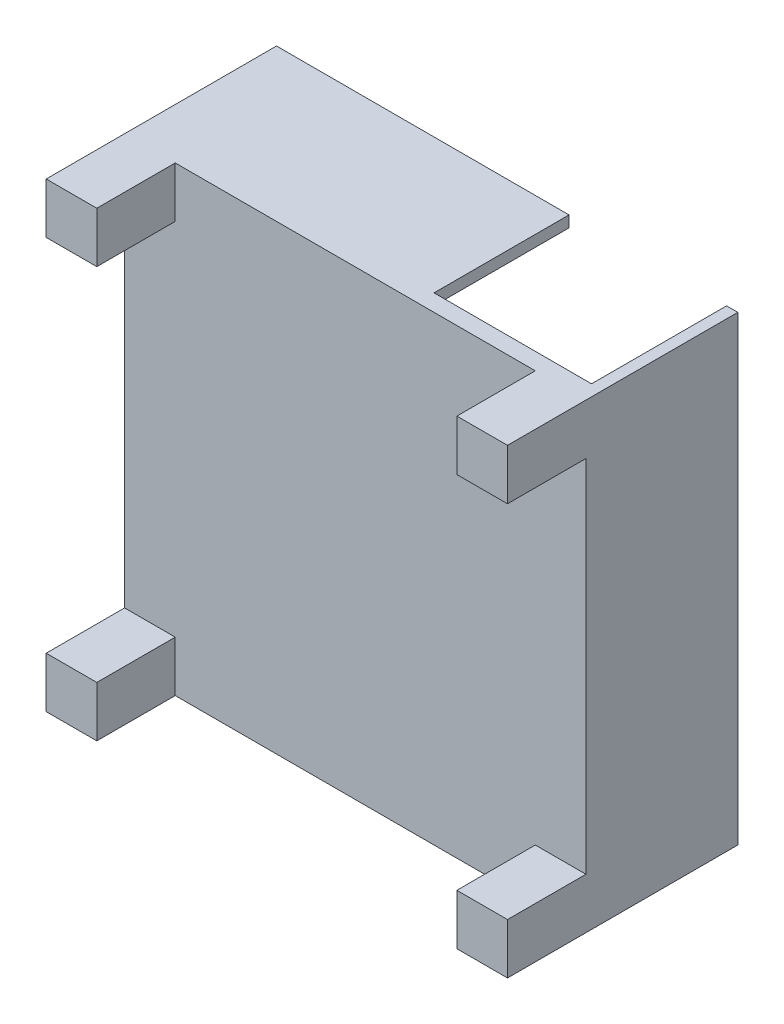
ISO-10303-21;
HEADER;
FILE_DESCRIPTION(('STEP AP214'),'2;1');
FILE_NAME('part.step','',(''),(''),'','','');
FILE_SCHEMA(('AUTOMOTIVE_DESIGN { 1 0 10303 214 1 1 1 1 }'));
ENDSEC;
DATA;
#1=APPLICATION_CONTEXT('core data for automotive mechanical design processes');
#2=APPLICATION_PROTOCOL_DEFINITION('international standard','automotive_design',2000,#1);
#3=PRODUCT_CONTEXT('',#1,'mechanical');
#4=PRODUCT('Part','Part','',(#3));
#5=PRODUCT_RELATED_PRODUCT_CATEGORY('part','',(#4));
#6=PRODUCT_DEFINITION_FORMATION('','',#4);
#7=PRODUCT_DEFINITION_CONTEXT('part definition',#1,'design');
#8=PRODUCT_DEFINITION('design','',#6,#7);
#9=PRODUCT_DEFINITION_SHAPE('','',#8);
#10=(LENGTH_UNIT() NAMED_UNIT(*) SI_UNIT(.MILLI.,.METRE.));
#11=(NAMED_UNIT(*) PLANE_ANGLE_UNIT() SI_UNIT($,.RADIAN.));
#12=(NAMED_UNIT(*) SI_UNIT($,.STERADIAN.) SOLID_ANGLE_UNIT());
#13=UNCERTAINTY_MEASURE_WITH_UNIT(LENGTH_MEASURE(1.E-05),#10,'distance_accuracy_value','');
#14=(GEOMETRIC_REPRESENTATION_CONTEXT(3) GLOBAL_UNCERTAINTY_ASSIGNED_CONTEXT((#13)) GLOBAL_UNIT_ASSIGNED_CONTEXT((#10,
#11,#12)) REPRESENTATION_CONTEXT('',''));
#15=CARTESIAN_POINT('',(0.,0.,0.));
#16=DIRECTION('',(0.,0.,1.));
#17=DIRECTION('',(1.,0.,0.));
#18=AXIS2_PLACEMENT_3D('',#15,#16,#17);
#19=CARTESIAN_POINT('',(0.,0.,0.));
#20=DIRECTION('',(0.,0.,-1.));
#21=DIRECTION('',(-1.,0.,0.));
#22=AXIS2_PLACEMENT_3D('',#19,#20,#21);
#23=PLANE('',#22);
#24=DIRECTION('',(-1.,0.,0.));
#25=VECTOR('',#24,1.);
#26=CARTESIAN_POINT('',(26.,40.,0.));
#27=LINE('',#26,#25);
#28=CARTESIAN_POINT('',(26.,40.,0.));
#29=VERTEX_POINT('',#28);
#30=CARTESIAN_POINT('',(0.,40.,0.));
#31=VERTEX_POINT('',#30);
#32=EDGE_CURVE('E51',#29,#31,#27,.T.);
#33=ORIENTED_EDGE('',*,*,#32,.F.);
#34=DIRECTION('',(0.,-1.,0.));
#35=VECTOR('',#34,1.);
#36=CARTESIAN_POINT('',(26.,41.,0.));
#37=LINE('',#36,#35);
#38=CARTESIAN_POINT('',(26.,41.,0.));
#39=VERTEX_POINT('',#38);
#40=EDGE_CURVE('E200',#39,#29,#37,.T.);
#41=ORIENTED_EDGE('',*,*,#40,.F.);
#42=DIRECTION('',(1.,0.,0.));
#43=VECTOR('',#42,1.);
#44=CARTESIAN_POINT('',(0.,41.,0.));
#45=LINE('',#44,#43);
#46=CARTESIAN_POINT('',(40.,41.,0.));
#47=VERTEX_POINT('',#46);
#48=EDGE_CURVE('E330',#39,#47,#45,.T.);
#49=ORIENTED_EDGE('',*,*,#48,.T.);
#50=DIRECTION('',(0.,1.,0.));
#51=VECTOR('',#50,1.);
#52=CARTESIAN_POINT('',(40.,41.,0.));
#53=LINE('',#52,#51);
#54=CARTESIAN_POINT('',(40.,0.,0.));
#55=VERTEX_POINT('',#54);
#56=EDGE_CURVE('E201',#55,#47,#53,.T.);
#57=ORIENTED_EDGE('',*,*,#56,.F.);
#58=DIRECTION('',(1.,0.,0.));
#59=VECTOR('',#58,1.);
#60=CARTESIAN_POINT('',(0.,0.,0.));
#61=LINE('',#60,#59);
#62=CARTESIAN_POINT('',(0.,0.,0.));
#63=VERTEX_POINT('',#62);
#64=EDGE_CURVE('E321',#63,#55,#61,.T.);
#65=ORIENTED_EDGE('',*,*,#64,.F.);
#66=DIRECTION('',(0.,1.,0.));
#67=VECTOR('',#66,1.);
#68=CARTESIAN_POINT('',(0.,0.,0.));
#69=LINE('',#68,#67);
#70=EDGE_CURVE('E56',#63,#31,#69,.T.);
#71=ORIENTED_EDGE('',*,*,#70,.T.);
#72=EDGE_LOOP('',(#33,#41,#49,#57,#65,#71));
#73=FACE_BOUND('',#72,.T.);
#74=ADVANCED_FACE('F34',(#73),#23,.T.);
#75=CARTESIAN_POINT('',(0.,0.,1.5));
#76=DIRECTION('',(0.,0.,-1.));
#77=DIRECTION('',(-1.,0.,0.));
#78=AXIS2_PLACEMENT_3D('',#75,#76,#77);
#79=PLANE('',#78);
#80=DIRECTION('',(0.,-1.,0.));
#81=VECTOR('',#80,1.);
#82=CARTESIAN_POINT('',(36.5,41.,1.5));
#83=LINE('',#82,#81);
#84=CARTESIAN_POINT('',(36.5,41.,1.5));
#85=VERTEX_POINT('',#84);
#86=CARTESIAN_POINT('',(36.5,36.5,1.5));
#87=VERTEX_POINT('',#86);
#88=EDGE_CURVE('E225',#85,#87,#83,.T.);
#89=ORIENTED_EDGE('',*,*,#88,.F.);
#90=DIRECTION('',(1.,0.,0.));
#91=VECTOR('',#90,1.);
#92=CARTESIAN_POINT('',(0.,41.,1.5));
#93=LINE('',#92,#91);
#94=CARTESIAN_POINT('',(4.5,41.,1.5));
#95=VERTEX_POINT('',#94);
#96=EDGE_CURVE('E320',#95,#85,#93,.T.);
#97=ORIENTED_EDGE('',*,*,#96,.F.);
#98=DIRECTION('',(0.,1.,0.));
#99=VECTOR('',#98,1.);
#100=CARTESIAN_POINT('',(4.5,41.,1.5));
#101=LINE('',#100,#99);
#102=CARTESIAN_POINT('',(4.5,36.5,1.5));
#103=VERTEX_POINT('',#102);
#104=EDGE_CURVE('E251',#103,#95,#101,.T.);
#105=ORIENTED_EDGE('',*,*,#104,.F.);
#106=DIRECTION('',(1.,0.,0.));
#107=VECTOR('',#106,1.);
#108=CARTESIAN_POINT('',(0.,36.5,1.5));
#109=LINE('',#108,#107);
#110=CARTESIAN_POINT('',(0.,36.5,1.5));
#111=VERTEX_POINT('',#110);
#112=EDGE_CURVE('E246',#111,#103,#109,.T.);
#113=ORIENTED_EDGE('',*,*,#112,.F.);
#114=DIRECTION('',(0.,1.,0.));
#115=VECTOR('',#114,1.);
#116=CARTESIAN_POINT('',(0.,0.,1.5));
#117=LINE('',#116,#115);
#118=CARTESIAN_POINT('',(0.,4.5,1.5));
#119=VERTEX_POINT('',#118);
#120=EDGE_CURVE('E317',#119,#111,#117,.T.);
#121=ORIENTED_EDGE('',*,*,#120,.F.);
#122=DIRECTION('',(-1.,0.,0.));
#123=VECTOR('',#122,1.);
#124=CARTESIAN_POINT('',(0.,4.5,1.5));
#125=LINE('',#124,#123);
#126=CARTESIAN_POINT('',(4.5,4.5,1.5));
#127=VERTEX_POINT('',#126);
#128=EDGE_CURVE('E298',#127,#119,#125,.T.);
#129=ORIENTED_EDGE('',*,*,#128,.F.);
#130=DIRECTION('',(0.,1.,0.));
#131=VECTOR('',#130,1.);
#132=CARTESIAN_POINT('',(4.5,0.,1.5));
#133=LINE('',#132,#131);
#134=CARTESIAN_POINT('',(4.5,0.,1.5));
#135=VERTEX_POINT('',#134);
#136=EDGE_CURVE('E293',#135,#127,#133,.T.);
#137=ORIENTED_EDGE('',*,*,#136,.F.);
#138=DIRECTION('',(1.,0.,0.));
#139=VECTOR('',#138,1.);
#140=CARTESIAN_POINT('',(0.,0.,1.5));
#141=LINE('',#140,#139);
#142=CARTESIAN_POINT('',(36.5,0.,1.5));
#143=VERTEX_POINT('',#142);
#144=EDGE_CURVE('E327',#135,#143,#141,.T.);
#145=ORIENTED_EDGE('',*,*,#144,.T.);
#146=DIRECTION('',(0.,-1.,0.));
#147=VECTOR('',#146,1.);
#148=CARTESIAN_POINT('',(36.5,0.,1.5));
#149=LINE('',#148,#147);
#150=CARTESIAN_POINT('',(36.5,4.5,1.5));
#151=VERTEX_POINT('',#150);
#152=EDGE_CURVE('E273',#151,#143,#149,.T.);
#153=ORIENTED_EDGE('',*,*,#152,.F.);
#154=DIRECTION('',(-1.,0.,0.));
#155=VECTOR('',#154,1.);
#156=CARTESIAN_POINT('',(41.,4.5,1.5));
#157=LINE('',#156,#155);
#158=CARTESIAN_POINT('',(41.,4.5,1.5));
#159=VERTEX_POINT('',#158);
#160=EDGE_CURVE('E268',#159,#151,#157,.T.);
#161=ORIENTED_EDGE('',*,*,#160,.F.);
#162=DIRECTION('',(0.,1.,0.));
#163=VECTOR('',#162,1.);
#164=CARTESIAN_POINT('',(41.,0.,1.5));
#165=LINE('',#164,#163);
#166=CARTESIAN_POINT('',(41.,36.5,1.5));
#167=VERTEX_POINT('',#166);
#168=EDGE_CURVE('E324',#159,#167,#165,.T.);
#169=ORIENTED_EDGE('',*,*,#168,.T.);
#170=DIRECTION('',(1.,0.,0.));
#171=VECTOR('',#170,1.);
#172=CARTESIAN_POINT('',(41.,36.5,1.5));
#173=LINE('',#172,#171);
#174=EDGE_CURVE('E230',#87,#167,#173,.T.);
#175=ORIENTED_EDGE('',*,*,#174,.F.);
#176=EDGE_LOOP('',(#89,#97,#105,#113,#121,#129,#137,#145,#153,#161,#169,#175));
#177=FACE_BOUND('',#176,.T.);
#178=ADVANCED_FACE('F364',(#177),#79,.F.);
#179=CARTESIAN_POINT('',(0.,0.,1.5));
#180=DIRECTION('',(-1.,0.,0.));
#181=DIRECTION('',(0.,0.,1.));
#182=AXIS2_PLACEMENT_3D('',#179,#180,#181);
#183=PLANE('',#182);
#184=ORIENTED_EDGE('',*,*,#70,.F.);
#185=DIRECTION('',(0.,0.,-1.));
#186=VECTOR('',#185,1.);
#187=CARTESIAN_POINT('',(0.,0.,1.5));
#188=LINE('',#187,#186);
#189=CARTESIAN_POINT('',(0.,0.,8.47));
#190=VERTEX_POINT('',#189);
#191=EDGE_CURVE('E11',#190,#63,#188,.T.);
#192=ORIENTED_EDGE('',*,*,#191,.F.);
#193=DIRECTION('',(0.,-1.,0.));
#194=VECTOR('',#193,1.);
#195=CARTESIAN_POINT('',(0.,0.,8.47));
#196=LINE('',#195,#194);
#197=CARTESIAN_POINT('',(0.,4.5,8.47));
#198=VERTEX_POINT('',#197);
#199=EDGE_CURVE('E294',#198,#190,#196,.T.);
#200=ORIENTED_EDGE('',*,*,#199,.F.);
#201=DIRECTION('',(0.,0.,-1.));
#202=VECTOR('',#201,1.);
#203=CARTESIAN_POINT('',(0.,4.5,8.47));
#204=LINE('',#203,#202);
#205=EDGE_CURVE('E304',#198,#119,#204,.T.);
#206=ORIENTED_EDGE('',*,*,#205,.T.);
#207=ORIENTED_EDGE('',*,*,#120,.T.);
#208=DIRECTION('',(0.,0.,-1.));
#209=VECTOR('',#208,1.);
#210=CARTESIAN_POINT('',(0.,36.5,8.47));
#211=LINE('',#210,#209);
#212=CARTESIAN_POINT('',(0.,36.5,8.47));
#213=VERTEX_POINT('',#212);
#214=EDGE_CURVE('E266',#213,#111,#211,.T.);
#215=ORIENTED_EDGE('',*,*,#214,.F.);
#216=DIRECTION('',(0.,-1.,0.));
#217=VECTOR('',#216,1.);
#218=CARTESIAN_POINT('',(0.,41.,8.47));
#219=LINE('',#218,#217);
#220=CARTESIAN_POINT('',(0.,41.,8.47));
#221=VERTEX_POINT('',#220);
#222=EDGE_CURVE('E247',#221,#213,#219,.T.);
#223=ORIENTED_EDGE('',*,*,#222,.F.);
#224=DIRECTION('',(0.,0.,-1.));
#225=VECTOR('',#224,1.);
#226=CARTESIAN_POINT('',(0.,41.,1.5));
#227=LINE('',#226,#225);
#228=CARTESIAN_POINT('',(0.,41.,-12.));
#229=VERTEX_POINT('',#228);
#230=EDGE_CURVE('E38',#221,#229,#227,.T.);
#231=ORIENTED_EDGE('',*,*,#230,.T.);
#232=DIRECTION('',(0.,1.,0.));
#233=VECTOR('',#232,1.);
#234=CARTESIAN_POINT('',(0.,41.,-12.));
#235=LINE('',#234,#233);
#236=CARTESIAN_POINT('',(0.,40.,-12.));
#237=VERTEX_POINT('',#236);
#238=EDGE_CURVE('E188',#237,#229,#235,.T.);
#239=ORIENTED_EDGE('',*,*,#238,.F.);
#240=DIRECTION('',(0.,0.,1.));
#241=VECTOR('',#240,1.);
#242=CARTESIAN_POINT('',(0.,40.,-12.));
#243=LINE('',#242,#241);
#244=EDGE_CURVE('E184',#237,#31,#243,.T.);
#245=ORIENTED_EDGE('',*,*,#244,.T.);
#246=EDGE_LOOP('',(#184,#192,#200,#206,#207,#215,#223,#231,#239,#245));
#247=FACE_BOUND('',#246,.T.);
#248=ADVANCED_FACE('F36',(#247),#183,.T.);
#249=CARTESIAN_POINT('',(0.,0.,1.5));
#250=DIRECTION('',(0.,1.,0.));
#251=DIRECTION('',(0.,0.,1.));
#252=AXIS2_PLACEMENT_3D('',#249,#250,#251);
#253=PLANE('',#252);
#254=ORIENTED_EDGE('',*,*,#64,.T.);
#255=DIRECTION('',(0.,0.,1.));
#256=VECTOR('',#255,1.);
#257=CARTESIAN_POINT('',(40.,0.,-12.));
#258=LINE('',#257,#256);
#259=CARTESIAN_POINT('',(40.,0.,-12.));
#260=VERTEX_POINT('',#259);
#261=EDGE_CURVE('E222',#260,#55,#258,.T.);
#262=ORIENTED_EDGE('',*,*,#261,.F.);
#263=DIRECTION('',(-1.,0.,0.));
#264=VECTOR('',#263,1.);
#265=CARTESIAN_POINT('',(41.,0.,-12.));
#266=LINE('',#265,#264);
#267=CARTESIAN_POINT('',(41.,0.,-12.));
#268=VERTEX_POINT('',#267);
#269=EDGE_CURVE('E212',#268,#260,#266,.T.);
#270=ORIENTED_EDGE('',*,*,#269,.F.);
#271=DIRECTION('',(0.,0.,-1.));
#272=VECTOR('',#271,1.);
#273=CARTESIAN_POINT('',(41.,0.,1.5));
#274=LINE('',#273,#272);
#275=CARTESIAN_POINT('',(41.,0.,8.47));
#276=VERTEX_POINT('',#275);
#277=EDGE_CURVE('E43',#276,#268,#274,.T.);
#278=ORIENTED_EDGE('',*,*,#277,.F.);
#279=DIRECTION('',(1.,0.,0.));
#280=VECTOR('',#279,1.);
#281=CARTESIAN_POINT('',(41.,0.,8.47));
#282=LINE('',#281,#280);
#283=CARTESIAN_POINT('',(36.5,0.,8.47));
#284=VERTEX_POINT('',#283);
#285=EDGE_CURVE('E277',#284,#276,#282,.T.);
#286=ORIENTED_EDGE('',*,*,#285,.F.);
#287=DIRECTION('',(0.,0.,-1.));
#288=VECTOR('',#287,1.);
#289=CARTESIAN_POINT('',(36.5,0.,8.47));
#290=LINE('',#289,#288);
#291=EDGE_CURVE('E280',#284,#143,#290,.T.);
#292=ORIENTED_EDGE('',*,*,#291,.T.);
#293=ORIENTED_EDGE('',*,*,#144,.F.);
#294=DIRECTION('',(0.,0.,-1.));
#295=VECTOR('',#294,1.);
#296=CARTESIAN_POINT('',(4.5,0.,8.47));
#297=LINE('',#296,#295);
#298=CARTESIAN_POINT('',(4.5,0.,8.47));
#299=VERTEX_POINT('',#298);
#300=EDGE_CURVE('E314',#299,#135,#297,.T.);
#301=ORIENTED_EDGE('',*,*,#300,.F.);
#302=DIRECTION('',(1.,0.,0.));
#303=VECTOR('',#302,1.);
#304=CARTESIAN_POINT('',(0.,0.,8.47));
#305=LINE('',#304,#303);
#306=EDGE_CURVE('E297',#190,#299,#305,.T.);
#307=ORIENTED_EDGE('',*,*,#306,.F.);
#308=ORIENTED_EDGE('',*,*,#191,.T.);
#309=EDGE_LOOP('',(#254,#262,#270,#278,#286,#292,#293,#301,#307,#308));
#310=FACE_BOUND('',#309,.T.);
#311=ADVANCED_FACE('F351',(#310),#253,.F.);
#312=CARTESIAN_POINT('',(41.,0.,1.5));
#313=DIRECTION('',(-1.,0.,0.));
#314=DIRECTION('',(0.,0.,1.));
#315=AXIS2_PLACEMENT_3D('',#312,#313,#314);
#316=PLANE('',#315);
#317=ORIENTED_EDGE('',*,*,#277,.T.);
#318=DIRECTION('',(0.,-1.,0.));
#319=VECTOR('',#318,1.);
#320=CARTESIAN_POINT('',(41.,41.,-12.));
#321=LINE('',#320,#319);
#322=CARTESIAN_POINT('',(41.,41.,-12.));
#323=VERTEX_POINT('',#322);
#324=EDGE_CURVE('E204',#323,#268,#321,.T.);
#325=ORIENTED_EDGE('',*,*,#324,.F.);
#326=DIRECTION('',(0.,0.,-1.));
#327=VECTOR('',#326,1.);
#328=CARTESIAN_POINT('',(41.,41.,1.5));
#329=LINE('',#328,#327);
#330=CARTESIAN_POINT('',(41.,41.,8.47));
#331=VERTEX_POINT('',#330);
#332=EDGE_CURVE('E334',#331,#323,#329,.T.);
#333=ORIENTED_EDGE('',*,*,#332,.F.);
#334=DIRECTION('',(0.,1.,0.));
#335=VECTOR('',#334,1.);
#336=CARTESIAN_POINT('',(41.,41.,8.47));
#337=LINE('',#336,#335);
#338=CARTESIAN_POINT('',(41.,36.5,8.47));
#339=VERTEX_POINT('',#338);
#340=EDGE_CURVE('E226',#339,#331,#337,.T.);
#341=ORIENTED_EDGE('',*,*,#340,.F.);
#342=DIRECTION('',(0.,0.,-1.));
#343=VECTOR('',#342,1.);
#344=CARTESIAN_POINT('',(41.,36.5,8.47));
#345=LINE('',#344,#343);
#346=EDGE_CURVE('E236',#339,#167,#345,.T.);
#347=ORIENTED_EDGE('',*,*,#346,.T.);
#348=ORIENTED_EDGE('',*,*,#168,.F.);
#349=DIRECTION('',(0.,0.,-1.));
#350=VECTOR('',#349,1.);
#351=CARTESIAN_POINT('',(41.,4.5,8.47));
#352=LINE('',#351,#350);
#353=CARTESIAN_POINT('',(41.,4.5,8.47));
#354=VERTEX_POINT('',#353);
#355=EDGE_CURVE('E290',#354,#159,#352,.T.);
#356=ORIENTED_EDGE('',*,*,#355,.F.);
#357=DIRECTION('',(0.,1.,0.));
#358=VECTOR('',#357,1.);
#359=CARTESIAN_POINT('',(41.,0.,8.47));
#360=LINE('',#359,#358);
#361=EDGE_CURVE('E269',#276,#354,#360,.T.);
#362=ORIENTED_EDGE('',*,*,#361,.F.);
#363=EDGE_LOOP('',(#317,#325,#333,#341,#347,#348,#356,#362));
#364=FACE_BOUND('',#363,.T.);
#365=ADVANCED_FACE('F390',(#364),#316,.F.);
#366=CARTESIAN_POINT('',(0.,41.,1.5));
#367=DIRECTION('',(0.,1.,0.));
#368=DIRECTION('',(0.,0.,1.));
#369=AXIS2_PLACEMENT_3D('',#366,#367,#368);
#370=PLANE('',#369);
#371=ORIENTED_EDGE('',*,*,#48,.F.);
#372=DIRECTION('',(0.,0.,1.));
#373=VECTOR('',#372,1.);
#374=CARTESIAN_POINT('',(26.,41.,-12.));
#375=LINE('',#374,#373);
#376=CARTESIAN_POINT('',(26.,41.,-12.));
#377=VERTEX_POINT('',#376);
#378=EDGE_CURVE('E206',#377,#39,#375,.T.);
#379=ORIENTED_EDGE('',*,*,#378,.F.);
#380=DIRECTION('',(1.,0.,0.));
#381=VECTOR('',#380,1.);
#382=CARTESIAN_POINT('',(26.,41.,-12.));
#383=LINE('',#382,#381);
#384=EDGE_CURVE('E194',#229,#377,#383,.T.);
#385=ORIENTED_EDGE('',*,*,#384,.F.);
#386=ORIENTED_EDGE('',*,*,#230,.F.);
#387=DIRECTION('',(-1.,0.,0.));
#388=VECTOR('',#387,1.);
#389=CARTESIAN_POINT('',(0.,41.,8.47));
#390=LINE('',#389,#388);
#391=CARTESIAN_POINT('',(4.5,41.,8.47));
#392=VERTEX_POINT('',#391);
#393=EDGE_CURVE('E255',#392,#221,#390,.T.);
#394=ORIENTED_EDGE('',*,*,#393,.F.);
#395=DIRECTION('',(0.,0.,-1.));
#396=VECTOR('',#395,1.);
#397=CARTESIAN_POINT('',(4.5,41.,8.47));
#398=LINE('',#397,#396);
#399=EDGE_CURVE('E258',#392,#95,#398,.T.);
#400=ORIENTED_EDGE('',*,*,#399,.T.);
#401=ORIENTED_EDGE('',*,*,#96,.T.);
#402=DIRECTION('',(0.,0.,-1.));
#403=VECTOR('',#402,1.);
#404=CARTESIAN_POINT('',(36.5,41.,8.47));
#405=LINE('',#404,#403);
#406=CARTESIAN_POINT('',(36.5,41.,8.47));
#407=VERTEX_POINT('',#406);
#408=EDGE_CURVE('E244',#407,#85,#405,.T.);
#409=ORIENTED_EDGE('',*,*,#408,.F.);
#410=DIRECTION('',(-1.,0.,0.));
#411=VECTOR('',#410,1.);
#412=CARTESIAN_POINT('',(41.,41.,8.47));
#413=LINE('',#412,#411);
#414=EDGE_CURVE('E229',#331,#407,#413,.T.);
#415=ORIENTED_EDGE('',*,*,#414,.F.);
#416=ORIENTED_EDGE('',*,*,#332,.T.);
#417=DIRECTION('',(1.,0.,0.));
#418=VECTOR('',#417,1.);
#419=CARTESIAN_POINT('',(41.,41.,-12.));
#420=LINE('',#419,#418);
#421=CARTESIAN_POINT('',(40.,41.,-12.));
#422=VERTEX_POINT('',#421);
#423=EDGE_CURVE('E216',#422,#323,#420,.T.);
#424=ORIENTED_EDGE('',*,*,#423,.F.);
#425=DIRECTION('',(0.,0.,1.));
#426=VECTOR('',#425,1.);
#427=CARTESIAN_POINT('',(40.,41.,-12.));
#428=LINE('',#427,#426);
#429=EDGE_CURVE('E218',#422,#47,#428,.T.);
#430=ORIENTED_EDGE('',*,*,#429,.T.);
#431=EDGE_LOOP('',(#371,#379,#385,#386,#394,#400,#401,#409,#415,#416,#424,#430));
#432=FACE_BOUND('',#431,.T.);
#433=ADVANCED_FACE('F343',(#432),#370,.T.);
#434=CARTESIAN_POINT('',(4.5,0.,8.47));
#435=DIRECTION('',(-1.,0.,0.));
#436=DIRECTION('',(0.,-1.,0.));
#437=AXIS2_PLACEMENT_3D('',#434,#435,#436);
#438=PLANE('',#437);
#439=ORIENTED_EDGE('',*,*,#136,.T.);
#440=DIRECTION('',(0.,0.,-1.));
#441=VECTOR('',#440,1.);
#442=CARTESIAN_POINT('',(4.5,4.5,8.47));
#443=LINE('',#442,#441);
#444=CARTESIAN_POINT('',(4.5,4.5,8.47));
#445=VERTEX_POINT('',#444);
#446=EDGE_CURVE('E311',#445,#127,#443,.T.);
#447=ORIENTED_EDGE('',*,*,#446,.F.);
#448=DIRECTION('',(0.,1.,0.));
#449=VECTOR('',#448,1.);
#450=CARTESIAN_POINT('',(4.5,0.,8.47));
#451=LINE('',#450,#449);
#452=EDGE_CURVE('E300',#299,#445,#451,.T.);
#453=ORIENTED_EDGE('',*,*,#452,.F.);
#454=ORIENTED_EDGE('',*,*,#300,.T.);
#455=EDGE_LOOP('',(#439,#447,#453,#454));
#456=FACE_BOUND('',#455,.T.);
#457=ADVANCED_FACE('F414',(#456),#438,.F.);
#458=CARTESIAN_POINT('',(0.,4.5,8.47));
#459=DIRECTION('',(0.,-1.,0.));
#460=DIRECTION('',(0.,0.,-1.));
#461=AXIS2_PLACEMENT_3D('',#458,#459,#460);
#462=PLANE('',#461);
#463=ORIENTED_EDGE('',*,*,#128,.T.);
#464=ORIENTED_EDGE('',*,*,#205,.F.);
#465=DIRECTION('',(-1.,0.,0.));
#466=VECTOR('',#465,1.);
#467=CARTESIAN_POINT('',(0.,4.5,8.47));
#468=LINE('',#467,#466);
#469=EDGE_CURVE('E302',#445,#198,#468,.T.);
#470=ORIENTED_EDGE('',*,*,#469,.F.);
#471=ORIENTED_EDGE('',*,*,#446,.T.);
#472=EDGE_LOOP('',(#463,#464,#470,#471));
#473=FACE_BOUND('',#472,.T.);
#474=ADVANCED_FACE('F360',(#473),#462,.F.);
#475=CARTESIAN_POINT('',(0.,0.,8.47));
#476=DIRECTION('',(0.,0.,-1.));
#477=DIRECTION('',(-1.,0.,0.));
#478=AXIS2_PLACEMENT_3D('',#475,#476,#477);
#479=PLANE('',#478);
#480=ORIENTED_EDGE('',*,*,#199,.T.);
#481=ORIENTED_EDGE('',*,*,#306,.T.);
#482=ORIENTED_EDGE('',*,*,#452,.T.);
#483=ORIENTED_EDGE('',*,*,#469,.T.);
#484=EDGE_LOOP('',(#480,#481,#482,#483));
#485=FACE_BOUND('',#484,.T.);
#486=ADVANCED_FACE('F355',(#485),#479,.F.);
#487=CARTESIAN_POINT('',(41.,4.5,8.47));
#488=DIRECTION('',(0.,-1.,0.));
#489=DIRECTION('',(1.,0.,0.));
#490=AXIS2_PLACEMENT_3D('',#487,#488,#489);
#491=PLANE('',#490);
#492=ORIENTED_EDGE('',*,*,#160,.T.);
#493=DIRECTION('',(0.,0.,-1.));
#494=VECTOR('',#493,1.);
#495=CARTESIAN_POINT('',(36.5,4.5,8.47));
#496=LINE('',#495,#494);
#497=CARTESIAN_POINT('',(36.5,4.5,8.47));
#498=VERTEX_POINT('',#497);
#499=EDGE_CURVE('E287',#498,#151,#496,.T.);
#500=ORIENTED_EDGE('',*,*,#499,.F.);
#501=DIRECTION('',(-1.,0.,0.));
#502=VECTOR('',#501,1.);
#503=CARTESIAN_POINT('',(41.,4.5,8.47));
#504=LINE('',#503,#502);
#505=EDGE_CURVE('E272',#354,#498,#504,.T.);
#506=ORIENTED_EDGE('',*,*,#505,.F.);
#507=ORIENTED_EDGE('',*,*,#355,.T.);
#508=EDGE_LOOP('',(#492,#500,#506,#507));
#509=FACE_BOUND('',#508,.T.);
#510=ADVANCED_FACE('F409',(#509),#491,.F.);
#511=CARTESIAN_POINT('',(36.5,0.,8.47));
#512=DIRECTION('',(1.,0.,0.));
#513=DIRECTION('',(0.,0.,-1.));
#514=AXIS2_PLACEMENT_3D('',#511,#512,#513);
#515=PLANE('',#514);
#516=ORIENTED_EDGE('',*,*,#152,.T.);
#517=ORIENTED_EDGE('',*,*,#291,.F.);
#518=DIRECTION('',(0.,-1.,0.));
#519=VECTOR('',#518,1.);
#520=CARTESIAN_POINT('',(36.5,0.,8.47));
#521=LINE('',#520,#519);
#522=EDGE_CURVE('E275',#498,#284,#521,.T.);
#523=ORIENTED_EDGE('',*,*,#522,.F.);
#524=ORIENTED_EDGE('',*,*,#499,.T.);
#525=EDGE_LOOP('',(#516,#517,#523,#524));
#526=FACE_BOUND('',#525,.T.);
#527=ADVANCED_FACE('F412',(#526),#515,.F.);
#528=CARTESIAN_POINT('',(0.,0.,8.47));
#529=DIRECTION('',(0.,0.,1.));
#530=DIRECTION('',(1.,0.,0.));
#531=AXIS2_PLACEMENT_3D('',#528,#529,#530);
#532=PLANE('',#531);
#533=ORIENTED_EDGE('',*,*,#361,.T.);
#534=ORIENTED_EDGE('',*,*,#505,.T.);
#535=ORIENTED_EDGE('',*,*,#522,.T.);
#536=ORIENTED_EDGE('',*,*,#285,.T.);
#537=EDGE_LOOP('',(#533,#534,#535,#536));
#538=FACE_BOUND('',#537,.T.);
#539=ADVANCED_FACE('F403',(#538),#532,.T.);
#540=CARTESIAN_POINT('',(0.,36.5,8.47));
#541=DIRECTION('',(0.,1.,0.));
#542=DIRECTION('',(0.,0.,1.));
#543=AXIS2_PLACEMENT_3D('',#540,#541,#542);
#544=PLANE('',#543);
#545=ORIENTED_EDGE('',*,*,#112,.T.);
#546=DIRECTION('',(0.,0.,-1.));
#547=VECTOR('',#546,1.);
#548=CARTESIAN_POINT('',(4.5,36.5,8.47));
#549=LINE('',#548,#547);
#550=CARTESIAN_POINT('',(4.5,36.5,8.47));
#551=VERTEX_POINT('',#550);
#552=EDGE_CURVE('E263',#551,#103,#549,.T.);
#553=ORIENTED_EDGE('',*,*,#552,.F.);
#554=DIRECTION('',(1.,0.,0.));
#555=VECTOR('',#554,1.);
#556=CARTESIAN_POINT('',(0.,36.5,8.47));
#557=LINE('',#556,#555);
#558=EDGE_CURVE('E250',#213,#551,#557,.T.);
#559=ORIENTED_EDGE('',*,*,#558,.F.);
#560=ORIENTED_EDGE('',*,*,#214,.T.);
#561=EDGE_LOOP('',(#545,#553,#559,#560));
#562=FACE_BOUND('',#561,.T.);
#563=ADVANCED_FACE('F369',(#562),#544,.F.);
#564=CARTESIAN_POINT('',(4.5,41.,8.47));
#565=DIRECTION('',(-1.,0.,0.));
#566=DIRECTION('',(0.,-1.,0.));
#567=AXIS2_PLACEMENT_3D('',#564,#565,#566);
#568=PLANE('',#567);
#569=ORIENTED_EDGE('',*,*,#104,.T.);
#570=ORIENTED_EDGE('',*,*,#399,.F.);
#571=DIRECTION('',(0.,1.,0.));
#572=VECTOR('',#571,1.);
#573=CARTESIAN_POINT('',(4.5,41.,8.47));
#574=LINE('',#573,#572);
#575=EDGE_CURVE('E253',#551,#392,#574,.T.);
#576=ORIENTED_EDGE('',*,*,#575,.F.);
#577=ORIENTED_EDGE('',*,*,#552,.T.);
#578=EDGE_LOOP('',(#569,#570,#576,#577));
#579=FACE_BOUND('',#578,.T.);
#580=ADVANCED_FACE('F372',(#579),#568,.F.);
#581=CARTESIAN_POINT('',(0.,0.,8.47));
#582=DIRECTION('',(0.,0.,1.));
#583=DIRECTION('',(1.,0.,0.));
#584=AXIS2_PLACEMENT_3D('',#581,#582,#583);
#585=PLANE('',#584);
#586=ORIENTED_EDGE('',*,*,#222,.T.);
#587=ORIENTED_EDGE('',*,*,#558,.T.);
#588=ORIENTED_EDGE('',*,*,#575,.T.);
#589=ORIENTED_EDGE('',*,*,#393,.T.);
#590=EDGE_LOOP('',(#586,#587,#588,#589));
#591=FACE_BOUND('',#590,.T.);
#592=ADVANCED_FACE('F375',(#591),#585,.T.);
#593=CARTESIAN_POINT('',(36.5,41.,8.47));
#594=DIRECTION('',(1.,0.,0.));
#595=DIRECTION('',(0.,0.,-1.));
#596=AXIS2_PLACEMENT_3D('',#593,#594,#595);
#597=PLANE('',#596);
#598=ORIENTED_EDGE('',*,*,#88,.T.);
#599=DIRECTION('',(0.,0.,-1.));
#600=VECTOR('',#599,1.);
#601=CARTESIAN_POINT('',(36.5,36.5,8.47));
#602=LINE('',#601,#600);
#603=CARTESIAN_POINT('',(36.5,36.5,8.47));
#604=VERTEX_POINT('',#603);
#605=EDGE_CURVE('E241',#604,#87,#602,.T.);
#606=ORIENTED_EDGE('',*,*,#605,.F.);
#607=DIRECTION('',(0.,-1.,0.));
#608=VECTOR('',#607,1.);
#609=CARTESIAN_POINT('',(36.5,41.,8.47));
#610=LINE('',#609,#608);
#611=EDGE_CURVE('E232',#407,#604,#610,.T.);
#612=ORIENTED_EDGE('',*,*,#611,.F.);
#613=ORIENTED_EDGE('',*,*,#408,.T.);
#614=EDGE_LOOP('',(#598,#606,#612,#613));
#615=FACE_BOUND('',#614,.T.);
#616=ADVANCED_FACE('F381',(#615),#597,.F.);
#617=CARTESIAN_POINT('',(41.,36.5,8.47));
#618=DIRECTION('',(0.,1.,0.));
#619=DIRECTION('',(0.,0.,1.));
#620=AXIS2_PLACEMENT_3D('',#617,#618,#619);
#621=PLANE('',#620);
#622=ORIENTED_EDGE('',*,*,#174,.T.);
#623=ORIENTED_EDGE('',*,*,#346,.F.);
#624=DIRECTION('',(1.,0.,0.));
#625=VECTOR('',#624,1.);
#626=CARTESIAN_POINT('',(41.,36.5,8.47));
#627=LINE('',#626,#625);
#628=EDGE_CURVE('E234',#604,#339,#627,.T.);
#629=ORIENTED_EDGE('',*,*,#628,.F.);
#630=ORIENTED_EDGE('',*,*,#605,.T.);
#631=EDGE_LOOP('',(#622,#623,#629,#630));
#632=FACE_BOUND('',#631,.T.);
#633=ADVANCED_FACE('F384',(#632),#621,.F.);
#634=CARTESIAN_POINT('',(0.,0.,8.47));
#635=DIRECTION('',(0.,0.,-1.));
#636=DIRECTION('',(-1.,0.,0.));
#637=AXIS2_PLACEMENT_3D('',#634,#635,#636);
#638=PLANE('',#637);
#639=ORIENTED_EDGE('',*,*,#340,.T.);
#640=ORIENTED_EDGE('',*,*,#414,.T.);
#641=ORIENTED_EDGE('',*,*,#611,.T.);
#642=ORIENTED_EDGE('',*,*,#628,.T.);
#643=EDGE_LOOP('',(#639,#640,#641,#642));
#644=FACE_BOUND('',#643,.T.);
#645=ADVANCED_FACE('F388',(#644),#638,.F.);
#646=CARTESIAN_POINT('',(40.,41.,-12.));
#647=DIRECTION('',(1.,0.,0.));
#648=DIRECTION('',(0.,1.,0.));
#649=AXIS2_PLACEMENT_3D('',#646,#647,#648);
#650=PLANE('',#649);
#651=ORIENTED_EDGE('',*,*,#56,.T.);
#652=ORIENTED_EDGE('',*,*,#429,.F.);
#653=DIRECTION('',(0.,1.,0.));
#654=VECTOR('',#653,1.);
#655=CARTESIAN_POINT('',(40.,41.,-12.));
#656=LINE('',#655,#654);
#657=EDGE_CURVE('E214',#260,#422,#656,.T.);
#658=ORIENTED_EDGE('',*,*,#657,.F.);
#659=ORIENTED_EDGE('',*,*,#261,.T.);
#660=EDGE_LOOP('',(#651,#652,#658,#659));
#661=FACE_BOUND('',#660,.T.);
#662=ADVANCED_FACE('F400',(#661),#650,.F.);
#663=CARTESIAN_POINT('',(0.,0.,-12.));
#664=DIRECTION('',(0.,0.,-1.));
#665=DIRECTION('',(-1.,0.,0.));
#666=AXIS2_PLACEMENT_3D('',#663,#664,#665);
#667=PLANE('',#666);
#668=ORIENTED_EDGE('',*,*,#324,.T.);
#669=ORIENTED_EDGE('',*,*,#269,.T.);
#670=ORIENTED_EDGE('',*,*,#657,.T.);
#671=ORIENTED_EDGE('',*,*,#423,.T.);
#672=EDGE_LOOP('',(#668,#669,#670,#671));
#673=FACE_BOUND('',#672,.T.);
#674=ADVANCED_FACE('F395',(#673),#667,.T.);
#675=CARTESIAN_POINT('',(26.,41.,-12.));
#676=DIRECTION('',(-1.,0.,0.));
#677=DIRECTION('',(0.,0.,1.));
#678=AXIS2_PLACEMENT_3D('',#675,#676,#677);
#679=PLANE('',#678);
#680=ORIENTED_EDGE('',*,*,#40,.T.);
#681=DIRECTION('',(0.,0.,1.));
#682=VECTOR('',#681,1.);
#683=CARTESIAN_POINT('',(26.,40.,-12.));
#684=LINE('',#683,#682);
#685=CARTESIAN_POINT('',(26.,40.,-12.));
#686=VERTEX_POINT('',#685);
#687=EDGE_CURVE('E181',#686,#29,#684,.T.);
#688=ORIENTED_EDGE('',*,*,#687,.F.);
#689=DIRECTION('',(0.,-1.,0.));
#690=VECTOR('',#689,1.);
#691=CARTESIAN_POINT('',(26.,41.,-12.));
#692=LINE('',#691,#690);
#693=EDGE_CURVE('E189',#377,#686,#692,.T.);
#694=ORIENTED_EDGE('',*,*,#693,.F.);
#695=ORIENTED_EDGE('',*,*,#378,.T.);
#696=EDGE_LOOP('',(#680,#688,#694,#695));
#697=FACE_BOUND('',#696,.T.);
#698=ADVANCED_FACE('F199',(#697),#679,.F.);
#699=CARTESIAN_POINT('',(26.,40.,-12.));
#700=DIRECTION('',(0.,1.,0.));
#701=DIRECTION('',(0.,0.,1.));
#702=AXIS2_PLACEMENT_3D('',#699,#700,#701);
#703=PLANE('',#702);
#704=ORIENTED_EDGE('',*,*,#32,.T.);
#705=ORIENTED_EDGE('',*,*,#244,.F.);
#706=DIRECTION('',(-1.,0.,0.));
#707=VECTOR('',#706,1.);
#708=CARTESIAN_POINT('',(26.,40.,-12.));
#709=LINE('',#708,#707);
#710=EDGE_CURVE('E177',#686,#237,#709,.T.);
#711=ORIENTED_EDGE('',*,*,#710,.F.);
#712=ORIENTED_EDGE('',*,*,#687,.T.);
#713=EDGE_LOOP('',(#704,#705,#711,#712));
#714=FACE_BOUND('',#713,.T.);
#715=ADVANCED_FACE('F179',(#714),#703,.F.);
#716=CARTESIAN_POINT('',(0.,0.,-12.));
#717=DIRECTION('',(0.,0.,-1.));
#718=DIRECTION('',(-1.,0.,0.));
#719=AXIS2_PLACEMENT_3D('',#716,#717,#718);
#720=PLANE('',#719);
#721=ORIENTED_EDGE('',*,*,#693,.T.);
#722=ORIENTED_EDGE('',*,*,#710,.T.);
#723=ORIENTED_EDGE('',*,*,#238,.T.);
#724=ORIENTED_EDGE('',*,*,#384,.T.);
#725=EDGE_LOOP('',(#721,#722,#723,#724));
#726=FACE_BOUND('',#725,.T.);
#727=ADVANCED_FACE('F192',(#726),#720,.T.);
#728=CLOSED_SHELL('',(#74,#178,#248,#311,#365,#433,#457,#474,#486,#510,#527,#539,#563,#580,#592,
#616,#633,#645,#662,#674,#698,#715,#727));
#729=MANIFOLD_SOLID_BREP('B2',#728);
#730=ADVANCED_BREP_SHAPE_REPRESENTATION('',(#18,#729),#14);
#731=SHAPE_DEFINITION_REPRESENTATION(#9,#730);
ENDSEC;
END-ISO-10303-21;
